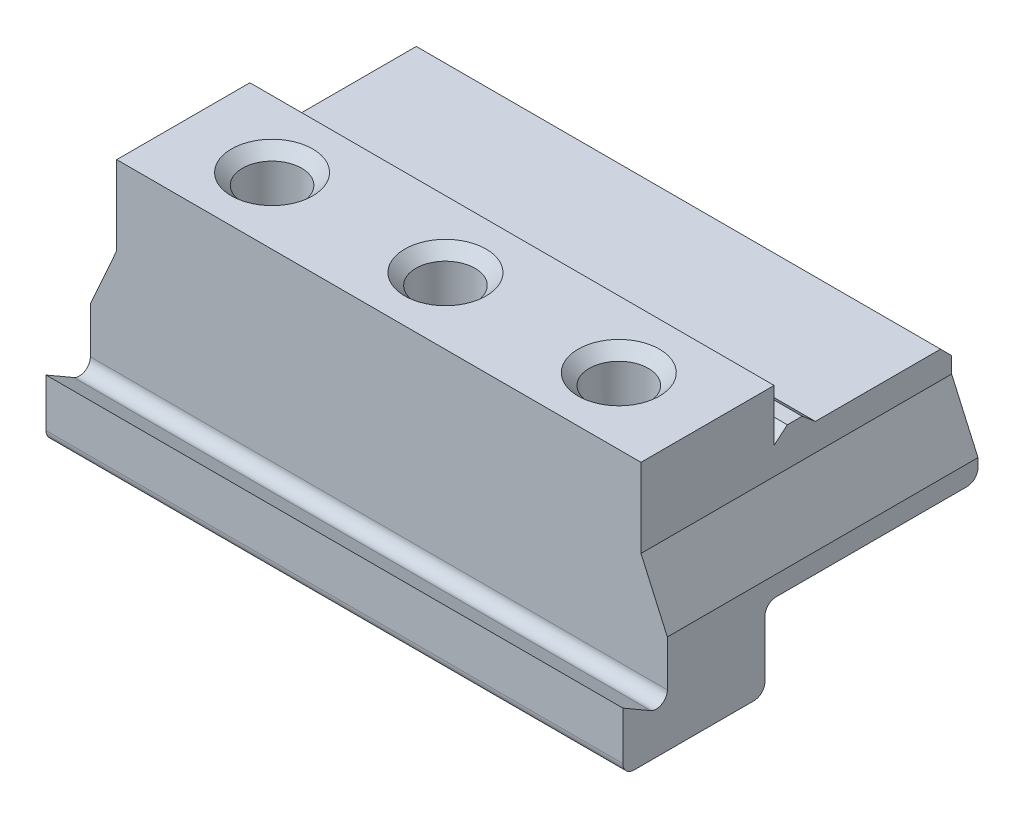
ISO-10303-21;
HEADER;
FILE_DESCRIPTION(('STEP AP214'),'2;1');
FILE_NAME('part.step','',(''),(''),'','','');
FILE_SCHEMA(('AUTOMOTIVE_DESIGN { 1 0 10303 214 1 1 1 1 }'));
ENDSEC;
DATA;
#1=APPLICATION_CONTEXT('core data for automotive mechanical design processes');
#2=APPLICATION_PROTOCOL_DEFINITION('international standard','automotive_design',2000,#1);
#3=PRODUCT_CONTEXT('',#1,'mechanical');
#4=PRODUCT('Part','Part','',(#3));
#5=PRODUCT_RELATED_PRODUCT_CATEGORY('part','',(#4));
#6=PRODUCT_DEFINITION_FORMATION('','',#4);
#7=PRODUCT_DEFINITION_CONTEXT('part definition',#1,'design');
#8=PRODUCT_DEFINITION('design','',#6,#7);
#9=PRODUCT_DEFINITION_SHAPE('','',#8);
#10=(LENGTH_UNIT() NAMED_UNIT(*) SI_UNIT(.MILLI.,.METRE.));
#11=(NAMED_UNIT(*) PLANE_ANGLE_UNIT() SI_UNIT($,.RADIAN.));
#12=(NAMED_UNIT(*) SI_UNIT($,.STERADIAN.) SOLID_ANGLE_UNIT());
#13=UNCERTAINTY_MEASURE_WITH_UNIT(LENGTH_MEASURE(1.E-05),#10,'distance_accuracy_value','');
#14=(GEOMETRIC_REPRESENTATION_CONTEXT(3) GLOBAL_UNCERTAINTY_ASSIGNED_CONTEXT((#13)) GLOBAL_UNIT_ASSIGNED_CONTEXT((#10,
#11,#12)) REPRESENTATION_CONTEXT('',''));
#15=CARTESIAN_POINT('',(0.,0.,0.));
#16=DIRECTION('',(0.,0.,1.));
#17=DIRECTION('',(1.,0.,0.));
#18=AXIS2_PLACEMENT_3D('',#15,#16,#17);
#19=CARTESIAN_POINT('',(39.,32.,24.));
#20=DIRECTION('',(-1.,0.,0.));
#21=DIRECTION('',(0.,0.,1.));
#22=AXIS2_PLACEMENT_3D('',#19,#20,#21);
#23=PLANE('',#22);
#24=DIRECTION('',(0.,0.,1.));
#25=VECTOR('',#24,1.);
#26=CARTESIAN_POINT('',(39.,10.67,24.));
#27=LINE('',#26,#25);
#28=CARTESIAN_POINT('',(39.,10.67,-22.5));
#29=VERTEX_POINT('',#28);
#30=CARTESIAN_POINT('',(39.,10.67,3.3));
#31=VERTEX_POINT('',#30);
#32=EDGE_CURVE('E420',#29,#31,#27,.T.);
#33=ORIENTED_EDGE('',*,*,#32,.F.);
#34=CARTESIAN_POINT('',(39.,12.17,-22.5));
#35=DIRECTION('',(-1.,0.,0.));
#36=DIRECTION('',(0.,0.,1.));
#37=AXIS2_PLACEMENT_3D('',#34,#35,#36);
#38=CIRCLE('',#37,1.5);
#39=CARTESIAN_POINT('',(39.,12.17,-24.));
#40=VERTEX_POINT('',#39);
#41=EDGE_CURVE('E263',#29,#40,#38,.F.);
#42=ORIENTED_EDGE('',*,*,#41,.T.);
#43=DIRECTION('',(0.,-1.,0.));
#44=VECTOR('',#43,1.);
#45=CARTESIAN_POINT('',(39.,32.,-24.));
#46=LINE('',#45,#44);
#47=CARTESIAN_POINT('',(39.,13.33,-24.));
#48=VERTEX_POINT('',#47);
#49=EDGE_CURVE('E234',#48,#40,#46,.T.);
#50=ORIENTED_EDGE('',*,*,#49,.F.);
#51=DIRECTION('',(0.,0.,1.));
#52=VECTOR('',#51,1.);
#53=CARTESIAN_POINT('',(39.,13.33,-24.));
#54=LINE('',#53,#52);
#55=CARTESIAN_POINT('',(39.,13.33,18.));
#56=VERTEX_POINT('',#55);
#57=EDGE_CURVE('E417',#48,#56,#54,.T.);
#58=ORIENTED_EDGE('',*,*,#57,.T.);
#59=DIRECTION('',(0.,1.,0.));
#60=VECTOR('',#59,1.);
#61=CARTESIAN_POINT('',(39.,32.,18.));
#62=LINE('',#61,#60);
#63=CARTESIAN_POINT('',(39.,7.13397459621554,18.));
#64=VERTEX_POINT('',#63);
#65=EDGE_CURVE('E441',#64,#56,#62,.T.);
#66=ORIENTED_EDGE('',*,*,#65,.F.);
#67=CARTESIAN_POINT('',(39.,7.13397459621554,19.5));
#68=DIRECTION('',(-1.,0.,0.));
#69=DIRECTION('',(0.,0.,1.));
#70=AXIS2_PLACEMENT_3D('',#67,#68,#69);
#71=CIRCLE('',#70,1.5);
#72=CARTESIAN_POINT('',(39.,5.83493649053888,20.25));
#73=VERTEX_POINT('',#72);
#74=EDGE_CURVE('E292',#64,#73,#71,.T.);
#75=ORIENTED_EDGE('',*,*,#74,.T.);
#76=DIRECTION('',(0.,-0.500000000000004,-0.866025403784436));
#77=VECTOR('',#76,1.);
#78=CARTESIAN_POINT('',(39.,14.0000000000001,34.3923048454133));
#79=LINE('',#78,#77);
#80=CARTESIAN_POINT('',(39.,8.,24.));
#81=VERTEX_POINT('',#80);
#82=EDGE_CURVE('E435',#81,#73,#79,.T.);
#83=ORIENTED_EDGE('',*,*,#82,.F.);
#84=DIRECTION('',(0.,-1.,0.));
#85=VECTOR('',#84,1.);
#86=CARTESIAN_POINT('',(39.,32.,24.));
#87=LINE('',#86,#85);
#88=CARTESIAN_POINT('',(39.,1.5,24.));
#89=VERTEX_POINT('',#88);
#90=EDGE_CURVE('E223',#81,#89,#87,.T.);
#91=ORIENTED_EDGE('',*,*,#90,.T.);
#92=CARTESIAN_POINT('',(39.,1.5,22.5));
#93=DIRECTION('',(-1.,0.,0.));
#94=DIRECTION('',(0.,0.,1.));
#95=AXIS2_PLACEMENT_3D('',#92,#93,#94);
#96=CIRCLE('',#95,1.5);
#97=CARTESIAN_POINT('',(39.,0.,22.5));
#98=VERTEX_POINT('',#97);
#99=EDGE_CURVE('E259',#89,#98,#96,.F.);
#100=ORIENTED_EDGE('',*,*,#99,.T.);
#101=DIRECTION('',(0.,0.,-1.));
#102=VECTOR('',#101,1.);
#103=CARTESIAN_POINT('',(39.,0.,24.));
#104=LINE('',#103,#102);
#105=CARTESIAN_POINT('',(39.,0.,6.3));
#106=VERTEX_POINT('',#105);
#107=EDGE_CURVE('E411',#98,#106,#104,.T.);
#108=ORIENTED_EDGE('',*,*,#107,.T.);
#109=CARTESIAN_POINT('',(39.,1.5,6.3));
#110=DIRECTION('',(-1.,0.,0.));
#111=DIRECTION('',(0.,0.,1.));
#112=AXIS2_PLACEMENT_3D('',#109,#110,#111);
#113=CIRCLE('',#112,1.5);
#114=CARTESIAN_POINT('',(39.,1.5,4.8));
#115=VERTEX_POINT('',#114);
#116=EDGE_CURVE('E261',#106,#115,#113,.F.);
#117=ORIENTED_EDGE('',*,*,#116,.T.);
#118=DIRECTION('',(0.,-1.,0.));
#119=VECTOR('',#118,1.);
#120=CARTESIAN_POINT('',(39.,32.,4.8));
#121=LINE('',#120,#119);
#122=CARTESIAN_POINT('',(39.,9.17,4.8));
#123=VERTEX_POINT('',#122);
#124=EDGE_CURVE('E437',#123,#115,#121,.T.);
#125=ORIENTED_EDGE('',*,*,#124,.F.);
#126=CARTESIAN_POINT('',(39.,9.17,3.3));
#127=DIRECTION('',(-1.,0.,0.));
#128=DIRECTION('',(0.,0.,1.));
#129=AXIS2_PLACEMENT_3D('',#126,#127,#128);
#130=CIRCLE('',#129,1.5);
#131=EDGE_CURVE('E288',#123,#31,#130,.T.);
#132=ORIENTED_EDGE('',*,*,#131,.T.);
#133=EDGE_LOOP('',(#33,#42,#50,#58,#66,#75,#83,#91,#100,#108,#117,#125,#132));
#134=FACE_BOUND('',#133,.T.);
#135=ADVANCED_FACE('F45',(#134),#23,.F.);
#136=CARTESIAN_POINT('',(-39.,32.,-24.));
#137=DIRECTION('',(0.,0.,1.));
#138=DIRECTION('',(1.,0.,0.));
#139=AXIS2_PLACEMENT_3D('',#136,#137,#138);
#140=PLANE('',#139);
#141=DIRECTION('',(0.,1.,0.));
#142=VECTOR('',#141,1.);
#143=CARTESIAN_POINT('',(-35.4381705175318,21.33,-24.));
#144=LINE('',#143,#142);
#145=CARTESIAN_POINT('',(-35.4381705175318,21.33,-24.));
#146=VERTEX_POINT('',#145);
#147=CARTESIAN_POINT('',(-35.4381705175318,23.5,-24.));
#148=VERTEX_POINT('',#147);
#149=EDGE_CURVE('E394',#146,#148,#144,.T.);
#150=ORIENTED_EDGE('',*,*,#149,.T.);
#151=DIRECTION('',(1.,0.,0.));
#152=VECTOR('',#151,1.);
#153=CARTESIAN_POINT('',(35.4381705175318,23.5,-24.));
#154=LINE('',#153,#152);
#155=CARTESIAN_POINT('',(35.4381705175318,23.5,-24.));
#156=VERTEX_POINT('',#155);
#157=EDGE_CURVE('E296',#148,#156,#154,.T.);
#158=ORIENTED_EDGE('',*,*,#157,.T.);
#159=DIRECTION('',(0.,-1.,0.));
#160=VECTOR('',#159,1.);
#161=CARTESIAN_POINT('',(35.4381705175318,21.33,-24.));
#162=LINE('',#161,#160);
#163=CARTESIAN_POINT('',(35.4381705175318,21.33,-24.));
#164=VERTEX_POINT('',#163);
#165=EDGE_CURVE('E404',#156,#164,#162,.T.);
#166=ORIENTED_EDGE('',*,*,#165,.T.);
#167=DIRECTION('',(0.406736643075794,-0.913545457642603,0.));
#168=VECTOR('',#167,1.);
#169=CARTESIAN_POINT('',(39.,13.33,-24.));
#170=LINE('',#169,#168);
#171=EDGE_CURVE('E423',#164,#48,#170,.T.);
#172=ORIENTED_EDGE('',*,*,#171,.T.);
#173=ORIENTED_EDGE('',*,*,#49,.T.);
#174=DIRECTION('',(1.,0.,0.));
#175=VECTOR('',#174,1.);
#176=CARTESIAN_POINT('',(-39.,12.17,-24.));
#177=LINE('',#176,#175);
#178=CARTESIAN_POINT('',(-39.,12.17,-24.));
#179=VERTEX_POINT('',#178);
#180=EDGE_CURVE('E265',#40,#179,#177,.F.);
#181=ORIENTED_EDGE('',*,*,#180,.T.);
#182=DIRECTION('',(0.,-1.,0.));
#183=VECTOR('',#182,1.);
#184=CARTESIAN_POINT('',(-39.,32.,-24.));
#185=LINE('',#184,#183);
#186=CARTESIAN_POINT('',(-39.,13.33,-24.));
#187=VERTEX_POINT('',#186);
#188=EDGE_CURVE('E232',#187,#179,#185,.T.);
#189=ORIENTED_EDGE('',*,*,#188,.F.);
#190=DIRECTION('',(0.406736643075794,0.913545457642603,0.));
#191=VECTOR('',#190,1.);
#192=CARTESIAN_POINT('',(-39.,13.33,-24.));
#193=LINE('',#192,#191);
#194=EDGE_CURVE('E398',#187,#146,#193,.T.);
#195=ORIENTED_EDGE('',*,*,#194,.T.);
#196=EDGE_LOOP('',(#150,#158,#166,#172,#173,#181,#189,#195));
#197=FACE_BOUND('',#196,.T.);
#198=ADVANCED_FACE('F335',(#197),#140,.F.);
#199=CARTESIAN_POINT('',(-39.,32.,24.));
#200=DIRECTION('',(1.,0.,0.));
#201=DIRECTION('',(0.,0.,-1.));
#202=AXIS2_PLACEMENT_3D('',#199,#200,#201);
#203=PLANE('',#202);
#204=ORIENTED_EDGE('',*,*,#188,.T.);
#205=CARTESIAN_POINT('',(-39.,12.17,-22.5));
#206=DIRECTION('',(1.,0.,0.));
#207=DIRECTION('',(0.,0.,-1.));
#208=AXIS2_PLACEMENT_3D('',#205,#206,#207);
#209=CIRCLE('',#208,1.5);
#210=CARTESIAN_POINT('',(-39.,10.67,-22.5));
#211=VERTEX_POINT('',#210);
#212=EDGE_CURVE('E270',#179,#211,#209,.F.);
#213=ORIENTED_EDGE('',*,*,#212,.T.);
#214=DIRECTION('',(0.,0.,-1.));
#215=VECTOR('',#214,1.);
#216=CARTESIAN_POINT('',(-39.,10.67,-24.));
#217=LINE('',#216,#215);
#218=CARTESIAN_POINT('',(-39.,10.67,3.3));
#219=VERTEX_POINT('',#218);
#220=EDGE_CURVE('E477',#219,#211,#217,.T.);
#221=ORIENTED_EDGE('',*,*,#220,.F.);
#222=CARTESIAN_POINT('',(-39.,9.17,3.3));
#223=DIRECTION('',(1.,0.,0.));
#224=DIRECTION('',(0.,0.,-1.));
#225=AXIS2_PLACEMENT_3D('',#222,#223,#224);
#226=CIRCLE('',#225,1.5);
#227=CARTESIAN_POINT('',(-39.,9.17,4.8));
#228=VERTEX_POINT('',#227);
#229=EDGE_CURVE('E290',#219,#228,#226,.T.);
#230=ORIENTED_EDGE('',*,*,#229,.T.);
#231=DIRECTION('',(0.,1.,0.));
#232=VECTOR('',#231,1.);
#233=CARTESIAN_POINT('',(-39.,10.67,4.8));
#234=LINE('',#233,#232);
#235=CARTESIAN_POINT('',(-39.,1.5,4.8));
#236=VERTEX_POINT('',#235);
#237=EDGE_CURVE('E480',#236,#228,#234,.T.);
#238=ORIENTED_EDGE('',*,*,#237,.F.);
#239=CARTESIAN_POINT('',(-39.,1.5,6.3));
#240=DIRECTION('',(1.,0.,0.));
#241=DIRECTION('',(0.,0.,-1.));
#242=AXIS2_PLACEMENT_3D('',#239,#240,#241);
#243=CIRCLE('',#242,1.5);
#244=CARTESIAN_POINT('',(-39.,0.,6.3));
#245=VERTEX_POINT('',#244);
#246=EDGE_CURVE('E268',#236,#245,#243,.F.);
#247=ORIENTED_EDGE('',*,*,#246,.T.);
#248=DIRECTION('',(0.,0.,1.));
#249=VECTOR('',#248,1.);
#250=CARTESIAN_POINT('',(-39.,0.,24.));
#251=LINE('',#250,#249);
#252=CARTESIAN_POINT('',(-39.,0.,22.5));
#253=VERTEX_POINT('',#252);
#254=EDGE_CURVE('E236',#245,#253,#251,.T.);
#255=ORIENTED_EDGE('',*,*,#254,.T.);
#256=CARTESIAN_POINT('',(-39.,1.5,22.5));
#257=DIRECTION('',(1.,0.,0.));
#258=DIRECTION('',(0.,0.,-1.));
#259=AXIS2_PLACEMENT_3D('',#256,#257,#258);
#260=CIRCLE('',#259,1.5);
#261=CARTESIAN_POINT('',(-39.,1.5,24.));
#262=VERTEX_POINT('',#261);
#263=EDGE_CURVE('E231',#253,#262,#260,.F.);
#264=ORIENTED_EDGE('',*,*,#263,.T.);
#265=DIRECTION('',(0.,-1.,0.));
#266=VECTOR('',#265,1.);
#267=CARTESIAN_POINT('',(-39.,32.,24.));
#268=LINE('',#267,#266);
#269=CARTESIAN_POINT('',(-39.,8.,24.));
#270=VERTEX_POINT('',#269);
#271=EDGE_CURVE('E220',#270,#262,#268,.T.);
#272=ORIENTED_EDGE('',*,*,#271,.F.);
#273=DIRECTION('',(0.,0.500000000000004,0.866025403784436));
#274=VECTOR('',#273,1.);
#275=CARTESIAN_POINT('',(-39.,8.,24.));
#276=LINE('',#275,#274);
#277=CARTESIAN_POINT('',(-39.,5.83493649053888,20.25));
#278=VERTEX_POINT('',#277);
#279=EDGE_CURVE('E201',#278,#270,#276,.T.);
#280=ORIENTED_EDGE('',*,*,#279,.F.);
#281=CARTESIAN_POINT('',(-39.,7.13397459621554,19.5));
#282=DIRECTION('',(1.,0.,0.));
#283=DIRECTION('',(0.,0.,-1.));
#284=AXIS2_PLACEMENT_3D('',#281,#282,#283);
#285=CIRCLE('',#284,1.5);
#286=CARTESIAN_POINT('',(-39.,7.13397459621554,18.));
#287=VERTEX_POINT('',#286);
#288=EDGE_CURVE('E294',#278,#287,#285,.T.);
#289=ORIENTED_EDGE('',*,*,#288,.T.);
#290=DIRECTION('',(0.,-1.,0.));
#291=VECTOR('',#290,1.);
#292=CARTESIAN_POINT('',(-39.,4.53589838486221,18.));
#293=LINE('',#292,#291);
#294=CARTESIAN_POINT('',(-39.,13.33,18.));
#295=VERTEX_POINT('',#294);
#296=EDGE_CURVE('E213',#295,#287,#293,.T.);
#297=ORIENTED_EDGE('',*,*,#296,.F.);
#298=DIRECTION('',(0.,0.,1.));
#299=VECTOR('',#298,1.);
#300=CARTESIAN_POINT('',(-39.,13.33,-24.));
#301=LINE('',#300,#299);
#302=EDGE_CURVE('E399',#187,#295,#301,.T.);
#303=ORIENTED_EDGE('',*,*,#302,.F.);
#304=EDGE_LOOP('',(#204,#213,#221,#230,#238,#247,#255,#264,#272,#280,#289,#297,#303));
#305=FACE_BOUND('',#304,.T.);
#306=ADVANCED_FACE('F228',(#305),#203,.F.);
#307=CARTESIAN_POINT('',(-39.,32.,24.));
#308=DIRECTION('',(0.,0.,-1.));
#309=DIRECTION('',(-1.,0.,0.));
#310=AXIS2_PLACEMENT_3D('',#307,#308,#309);
#311=PLANE('',#310);
#312=ORIENTED_EDGE('',*,*,#271,.T.);
#313=DIRECTION('',(1.,0.,0.));
#314=VECTOR('',#313,1.);
#315=CARTESIAN_POINT('',(39.,1.5,24.));
#316=LINE('',#315,#314);
#317=EDGE_CURVE('E282',#262,#89,#316,.T.);
#318=ORIENTED_EDGE('',*,*,#317,.T.);
#319=ORIENTED_EDGE('',*,*,#90,.F.);
#320=DIRECTION('',(1.,0.,0.));
#321=VECTOR('',#320,1.);
#322=CARTESIAN_POINT('',(-39.,8.,24.));
#323=LINE('',#322,#321);
#324=EDGE_CURVE('E205',#270,#81,#323,.T.);
#325=ORIENTED_EDGE('',*,*,#324,.F.);
#326=EDGE_LOOP('',(#312,#318,#319,#325));
#327=FACE_BOUND('',#326,.T.);
#328=ADVANCED_FACE('F218',(#327),#311,.F.);
#329=CARTESIAN_POINT('',(0.,32.,0.));
#330=DIRECTION('',(0.,-1.,0.));
#331=DIRECTION('',(0.,0.,-1.));
#332=AXIS2_PLACEMENT_3D('',#329,#330,#331);
#333=PLANE('',#332);
#334=CARTESIAN_POINT('',(-23.4381705175318,32.,9.00000000000001));
#335=DIRECTION('',(0.,-1.,0.));
#336=DIRECTION('',(0.,0.,-1.));
#337=AXIS2_PLACEMENT_3D('',#334,#335,#336);
#338=CIRCLE('',#337,5.50000000000005);
#339=CARTESIAN_POINT('',(-23.4381705175318,32.,3.49999999999996));
#340=VERTEX_POINT('',#339);
#341=EDGE_CURVE('E312',#340,#340,#338,.T.);
#342=ORIENTED_EDGE('',*,*,#341,.T.);
#343=EDGE_LOOP('',(#342));
#344=FACE_BOUND('',#343,.T.);
#345=CARTESIAN_POINT('',(0.,32.,9.));
#346=DIRECTION('',(0.,-1.,0.));
#347=DIRECTION('',(0.,0.,-1.));
#348=AXIS2_PLACEMENT_3D('',#345,#346,#347);
#349=CIRCLE('',#348,5.50000000000005);
#350=CARTESIAN_POINT('',(0.,32.,3.49999999999996));
#351=VERTEX_POINT('',#350);
#352=EDGE_CURVE('E309',#351,#351,#349,.T.);
#353=ORIENTED_EDGE('',*,*,#352,.T.);
#354=EDGE_LOOP('',(#353));
#355=FACE_BOUND('',#354,.T.);
#356=CARTESIAN_POINT('',(23.4381705175318,32.,9.00000000000001));
#357=DIRECTION('',(0.,-1.,0.));
#358=DIRECTION('',(0.,0.,-1.));
#359=AXIS2_PLACEMENT_3D('',#356,#357,#358);
#360=CIRCLE('',#359,5.50000000000005);
#361=CARTESIAN_POINT('',(23.4381705175318,32.,3.49999999999996));
#362=VERTEX_POINT('',#361);
#363=EDGE_CURVE('E306',#362,#362,#360,.T.);
#364=ORIENTED_EDGE('',*,*,#363,.T.);
#365=EDGE_LOOP('',(#364));
#366=FACE_BOUND('',#365,.T.);
#367=DIRECTION('',(1.,0.,0.));
#368=VECTOR('',#367,1.);
#369=CARTESIAN_POINT('',(-39.,32.,18.));
#370=LINE('',#369,#368);
#371=CARTESIAN_POINT('',(-35.4381705175318,32.,18.));
#372=VERTEX_POINT('',#371);
#373=CARTESIAN_POINT('',(35.4381705175318,32.,18.));
#374=VERTEX_POINT('',#373);
#375=EDGE_CURVE('E225',#372,#374,#370,.T.);
#376=ORIENTED_EDGE('',*,*,#375,.T.);
#377=DIRECTION('',(0.,0.,1.));
#378=VECTOR('',#377,1.);
#379=CARTESIAN_POINT('',(35.4381705175318,32.,-24.));
#380=LINE('',#379,#378);
#381=CARTESIAN_POINT('',(35.4381705175318,32.,0.));
#382=VERTEX_POINT('',#381);
#383=EDGE_CURVE('E416',#382,#374,#380,.T.);
#384=ORIENTED_EDGE('',*,*,#383,.F.);
#385=DIRECTION('',(1.,0.,0.));
#386=VECTOR('',#385,1.);
#387=CARTESIAN_POINT('',(-39.,32.,0.));
#388=LINE('',#387,#386);
#389=CARTESIAN_POINT('',(-35.4381705175318,32.,0.));
#390=VERTEX_POINT('',#389);
#391=EDGE_CURVE('E471',#390,#382,#388,.T.);
#392=ORIENTED_EDGE('',*,*,#391,.F.);
#393=DIRECTION('',(0.,0.,1.));
#394=VECTOR('',#393,1.);
#395=CARTESIAN_POINT('',(-35.4381705175318,32.,-24.));
#396=LINE('',#395,#394);
#397=EDGE_CURVE('E408',#390,#372,#396,.T.);
#398=ORIENTED_EDGE('',*,*,#397,.T.);
#399=EDGE_LOOP('',(#376,#384,#392,#398));
#400=FACE_BOUND('',#399,.T.);
#401=ADVANCED_FACE('F559',(#344,#355,#366,#400),#333,.F.);
#402=CARTESIAN_POINT('',(0.,0.,0.));
#403=DIRECTION('',(0.,-1.,0.));
#404=DIRECTION('',(0.,0.,-1.));
#405=AXIS2_PLACEMENT_3D('',#402,#403,#404);
#406=PLANE('',#405);
#407=ORIENTED_EDGE('',*,*,#254,.F.);
#408=DIRECTION('',(1.,0.,0.));
#409=VECTOR('',#408,1.);
#410=CARTESIAN_POINT('',(0.,0.,6.3));
#411=LINE('',#410,#409);
#412=EDGE_CURVE('E279',#245,#106,#411,.T.);
#413=ORIENTED_EDGE('',*,*,#412,.T.);
#414=ORIENTED_EDGE('',*,*,#107,.F.);
#415=DIRECTION('',(1.,0.,0.));
#416=VECTOR('',#415,1.);
#417=CARTESIAN_POINT('',(-39.,0.,22.5));
#418=LINE('',#417,#416);
#419=EDGE_CURVE('E277',#98,#253,#418,.F.);
#420=ORIENTED_EDGE('',*,*,#419,.T.);
#421=EDGE_LOOP('',(#407,#413,#414,#420));
#422=FACE_BOUND('',#421,.T.);
#423=ADVANCED_FACE('F557',(#422),#406,.T.);
#424=CARTESIAN_POINT('',(39.,13.33,-24.));
#425=DIRECTION('',(-0.913545457642604,-0.406736643075794,0.));
#426=DIRECTION('',(0.406736643075794,-0.913545457642604,0.));
#427=AXIS2_PLACEMENT_3D('',#424,#425,#426);
#428=PLANE('',#427);
#429=DIRECTION('',(-0.406736643075794,0.913545457642604,0.));
#430=VECTOR('',#429,1.);
#431=CARTESIAN_POINT('',(39.,13.33,18.));
#432=LINE('',#431,#430);
#433=CARTESIAN_POINT('',(35.4381705175318,21.33,18.));
#434=VERTEX_POINT('',#433);
#435=EDGE_CURVE('E445',#56,#434,#432,.T.);
#436=ORIENTED_EDGE('',*,*,#435,.F.);
#437=ORIENTED_EDGE('',*,*,#57,.F.);
#438=ORIENTED_EDGE('',*,*,#171,.F.);
#439=DIRECTION('',(0.,0.,1.));
#440=VECTOR('',#439,1.);
#441=CARTESIAN_POINT('',(35.4381705175318,21.33,-24.));
#442=LINE('',#441,#440);
#443=EDGE_CURVE('E413',#164,#434,#442,.T.);
#444=ORIENTED_EDGE('',*,*,#443,.T.);
#445=EDGE_LOOP('',(#436,#437,#438,#444));
#446=FACE_BOUND('',#445,.T.);
#447=ADVANCED_FACE('F554',(#446),#428,.F.);
#448=CARTESIAN_POINT('',(35.4381705175318,21.33,-24.));
#449=DIRECTION('',(-1.,0.,0.));
#450=DIRECTION('',(0.,0.,1.));
#451=AXIS2_PLACEMENT_3D('',#448,#449,#450);
#452=PLANE('',#451);
#453=ORIENTED_EDGE('',*,*,#165,.F.);
#454=DIRECTION('',(0.,0.707106781186544,0.707106781186551));
#455=VECTOR('',#454,1.);
#456=CARTESIAN_POINT('',(35.4381705175318,23.5,-24.));
#457=LINE('',#456,#455);
#458=CARTESIAN_POINT('',(35.4381705175318,25.,-22.5));
#459=VERTEX_POINT('',#458);
#460=EDGE_CURVE('E69',#156,#459,#457,.T.);
#461=ORIENTED_EDGE('',*,*,#460,.T.);
#462=DIRECTION('',(0.,0.,-1.));
#463=VECTOR('',#462,1.);
#464=CARTESIAN_POINT('',(35.4381705175318,25.,-24.));
#465=LINE('',#464,#463);
#466=CARTESIAN_POINT('',(35.4381705175318,25.,-5.57526077778262));
#467=VERTEX_POINT('',#466);
#468=EDGE_CURVE('E224',#467,#459,#465,.T.);
#469=ORIENTED_EDGE('',*,*,#468,.F.);
#470=DIRECTION('',(0.,-0.642787609686541,-0.766044443118977));
#471=VECTOR('',#470,1.);
#472=CARTESIAN_POINT('',(35.4381705175318,14.4112313893849,-18.1944638106319));
#473=LINE('',#472,#471);
#474=CARTESIAN_POINT('',(35.4381705175318,26.5,-3.78763038889131));
#475=VERTEX_POINT('',#474);
#476=EDGE_CURVE('E457',#475,#467,#473,.T.);
#477=ORIENTED_EDGE('',*,*,#476,.F.);
#478=DIRECTION('',(0.,0.,-1.));
#479=VECTOR('',#478,1.);
#480=CARTESIAN_POINT('',(35.4381705175318,26.5,-24.));
#481=LINE('',#480,#479);
#482=CARTESIAN_POINT('',(35.4381705175318,26.5,-1.78763038889131));
#483=VERTEX_POINT('',#482);
#484=EDGE_CURVE('E455',#483,#475,#481,.T.);
#485=ORIENTED_EDGE('',*,*,#484,.F.);
#486=DIRECTION('',(0.,0.642787609686541,-0.766044443118977));
#487=VECTOR('',#486,1.);
#488=CARTESIAN_POINT('',(35.4381705175318,35.3013374421653,-12.2766559052257));
#489=LINE('',#488,#487);
#490=CARTESIAN_POINT('',(35.4381705175318,25.,0.));
#491=VERTEX_POINT('',#490);
#492=EDGE_CURVE('E453',#491,#483,#489,.T.);
#493=ORIENTED_EDGE('',*,*,#492,.F.);
#494=DIRECTION('',(0.,-1.,0.));
#495=VECTOR('',#494,1.);
#496=CARTESIAN_POINT('',(35.4381705175318,21.33,0.));
#497=LINE('',#496,#495);
#498=EDGE_CURVE('E451',#382,#491,#497,.T.);
#499=ORIENTED_EDGE('',*,*,#498,.F.);
#500=ORIENTED_EDGE('',*,*,#383,.T.);
#501=DIRECTION('',(0.,1.,0.));
#502=VECTOR('',#501,1.);
#503=CARTESIAN_POINT('',(35.4381705175318,21.33,18.));
#504=LINE('',#503,#502);
#505=EDGE_CURVE('E447',#434,#374,#504,.T.);
#506=ORIENTED_EDGE('',*,*,#505,.F.);
#507=ORIENTED_EDGE('',*,*,#443,.F.);
#508=EDGE_LOOP('',(#453,#461,#469,#477,#485,#493,#499,#500,#506,#507));
#509=FACE_BOUND('',#508,.T.);
#510=ADVANCED_FACE('F550',(#509),#452,.F.);
#511=CARTESIAN_POINT('',(-39.,13.33,-24.));
#512=DIRECTION('',(0.913545457642604,-0.406736643075794,0.));
#513=DIRECTION('',(0.406736643075794,0.913545457642604,0.));
#514=AXIS2_PLACEMENT_3D('',#511,#512,#513);
#515=PLANE('',#514);
#516=DIRECTION('',(-0.406736643075794,-0.913545457642604,0.));
#517=VECTOR('',#516,1.);
#518=CARTESIAN_POINT('',(-39.,13.33,18.));
#519=LINE('',#518,#517);
#520=CARTESIAN_POINT('',(-35.4381705175318,21.33,18.));
#521=VERTEX_POINT('',#520);
#522=EDGE_CURVE('E449',#521,#295,#519,.T.);
#523=ORIENTED_EDGE('',*,*,#522,.F.);
#524=DIRECTION('',(0.,0.,1.));
#525=VECTOR('',#524,1.);
#526=CARTESIAN_POINT('',(-35.4381705175318,21.33,-24.));
#527=LINE('',#526,#525);
#528=EDGE_CURVE('E402',#146,#521,#527,.T.);
#529=ORIENTED_EDGE('',*,*,#528,.F.);
#530=ORIENTED_EDGE('',*,*,#194,.F.);
#531=ORIENTED_EDGE('',*,*,#302,.T.);
#532=EDGE_LOOP('',(#523,#529,#530,#531));
#533=FACE_BOUND('',#532,.T.);
#534=ADVANCED_FACE('F547',(#533),#515,.F.);
#535=CARTESIAN_POINT('',(-35.4381705175318,21.33,-24.));
#536=DIRECTION('',(1.,0.,0.));
#537=DIRECTION('',(0.,0.,-1.));
#538=AXIS2_PLACEMENT_3D('',#535,#536,#537);
#539=PLANE('',#538);
#540=DIRECTION('',(0.,0.,1.));
#541=VECTOR('',#540,1.);
#542=CARTESIAN_POINT('',(-35.4381705175318,25.,-24.));
#543=LINE('',#542,#541);
#544=CARTESIAN_POINT('',(-35.4381705175318,25.,-22.5));
#545=VERTEX_POINT('',#544);
#546=CARTESIAN_POINT('',(-35.4381705175318,25.,-5.57526077778262));
#547=VERTEX_POINT('',#546);
#548=EDGE_CURVE('E242',#545,#547,#543,.T.);
#549=ORIENTED_EDGE('',*,*,#548,.F.);
#550=DIRECTION('',(0.,-0.707106781186544,-0.707106781186551));
#551=VECTOR('',#550,1.);
#552=CARTESIAN_POINT('',(-35.4381705175318,23.5,-24.));
#553=LINE('',#552,#551);
#554=EDGE_CURVE('E301',#545,#148,#553,.T.);
#555=ORIENTED_EDGE('',*,*,#554,.T.);
#556=ORIENTED_EDGE('',*,*,#149,.F.);
#557=ORIENTED_EDGE('',*,*,#528,.T.);
#558=DIRECTION('',(0.,-1.,0.));
#559=VECTOR('',#558,1.);
#560=CARTESIAN_POINT('',(-35.4381705175318,21.33,18.));
#561=LINE('',#560,#559);
#562=EDGE_CURVE('E252',#372,#521,#561,.T.);
#563=ORIENTED_EDGE('',*,*,#562,.F.);
#564=ORIENTED_EDGE('',*,*,#397,.F.);
#565=DIRECTION('',(0.,1.,0.));
#566=VECTOR('',#565,1.);
#567=CARTESIAN_POINT('',(-35.4381705175318,21.33,0.));
#568=LINE('',#567,#566);
#569=CARTESIAN_POINT('',(-35.4381705175318,25.,0.));
#570=VERTEX_POINT('',#569);
#571=EDGE_CURVE('E250',#570,#390,#568,.T.);
#572=ORIENTED_EDGE('',*,*,#571,.F.);
#573=DIRECTION('',(0.,-0.642787609686541,0.766044443118977));
#574=VECTOR('',#573,1.);
#575=CARTESIAN_POINT('',(-35.4381705175318,35.3013374421653,-12.2766559052257));
#576=LINE('',#575,#574);
#577=CARTESIAN_POINT('',(-35.4381705175318,26.5,-1.78763038889131));
#578=VERTEX_POINT('',#577);
#579=EDGE_CURVE('E248',#578,#570,#576,.T.);
#580=ORIENTED_EDGE('',*,*,#579,.F.);
#581=DIRECTION('',(0.,0.,1.));
#582=VECTOR('',#581,1.);
#583=CARTESIAN_POINT('',(-35.4381705175318,26.5,-24.));
#584=LINE('',#583,#582);
#585=CARTESIAN_POINT('',(-35.4381705175318,26.5,-3.78763038889131));
#586=VERTEX_POINT('',#585);
#587=EDGE_CURVE('E246',#586,#578,#584,.T.);
#588=ORIENTED_EDGE('',*,*,#587,.F.);
#589=DIRECTION('',(0.,0.642787609686541,0.766044443118977));
#590=VECTOR('',#589,1.);
#591=CARTESIAN_POINT('',(-35.4381705175318,14.4112313893849,-18.1944638106319));
#592=LINE('',#591,#590);
#593=EDGE_CURVE('E244',#547,#586,#592,.T.);
#594=ORIENTED_EDGE('',*,*,#593,.F.);
#595=EDGE_LOOP('',(#549,#555,#556,#557,#563,#564,#572,#580,#588,#594));
#596=FACE_BOUND('',#595,.T.);
#597=ADVANCED_FACE('F392',(#596),#539,.F.);
#598=CARTESIAN_POINT('',(-39.,25.,-5.57526077778262));
#599=DIRECTION('',(0.,1.,0.));
#600=DIRECTION('',(0.,0.,1.));
#601=AXIS2_PLACEMENT_3D('',#598,#599,#600);
#602=PLANE('',#601);
#603=ORIENTED_EDGE('',*,*,#468,.T.);
#604=DIRECTION('',(-1.,0.,0.));
#605=VECTOR('',#604,1.);
#606=CARTESIAN_POINT('',(-35.4381705175318,25.,-22.5));
#607=LINE('',#606,#605);
#608=EDGE_CURVE('E61',#459,#545,#607,.T.);
#609=ORIENTED_EDGE('',*,*,#608,.T.);
#610=ORIENTED_EDGE('',*,*,#548,.T.);
#611=DIRECTION('',(1.,0.,0.));
#612=VECTOR('',#611,1.);
#613=CARTESIAN_POINT('',(-39.,25.,-5.57526077778262));
#614=LINE('',#613,#612);
#615=EDGE_CURVE('E212',#547,#467,#614,.T.);
#616=ORIENTED_EDGE('',*,*,#615,.T.);
#617=EDGE_LOOP('',(#603,#609,#610,#616));
#618=FACE_BOUND('',#617,.T.);
#619=ADVANCED_FACE('F535',(#618),#602,.T.);
#620=CARTESIAN_POINT('',(-39.,26.5,-3.78763038889131));
#621=DIRECTION('',(0.,0.766044443118977,-0.642787609686541));
#622=DIRECTION('',(0.,0.642787609686541,0.766044443118977));
#623=AXIS2_PLACEMENT_3D('',#620,#621,#622);
#624=PLANE('',#623);
#625=ORIENTED_EDGE('',*,*,#476,.T.);
#626=ORIENTED_EDGE('',*,*,#615,.F.);
#627=ORIENTED_EDGE('',*,*,#593,.T.);
#628=DIRECTION('',(1.,0.,0.));
#629=VECTOR('',#628,1.);
#630=CARTESIAN_POINT('',(-39.,26.5,-3.78763038889131));
#631=LINE('',#630,#629);
#632=EDGE_CURVE('E462',#586,#475,#631,.T.);
#633=ORIENTED_EDGE('',*,*,#632,.T.);
#634=EDGE_LOOP('',(#625,#626,#627,#633));
#635=FACE_BOUND('',#634,.T.);
#636=ADVANCED_FACE('F531',(#635),#624,.T.);
#637=CARTESIAN_POINT('',(-39.,26.5,-1.78763038889131));
#638=DIRECTION('',(0.,1.,0.));
#639=DIRECTION('',(0.,0.,1.));
#640=AXIS2_PLACEMENT_3D('',#637,#638,#639);
#641=PLANE('',#640);
#642=ORIENTED_EDGE('',*,*,#484,.T.);
#643=ORIENTED_EDGE('',*,*,#632,.F.);
#644=ORIENTED_EDGE('',*,*,#587,.T.);
#645=DIRECTION('',(1.,0.,0.));
#646=VECTOR('',#645,1.);
#647=CARTESIAN_POINT('',(-39.,26.5,-1.78763038889131));
#648=LINE('',#647,#646);
#649=EDGE_CURVE('E465',#578,#483,#648,.T.);
#650=ORIENTED_EDGE('',*,*,#649,.T.);
#651=EDGE_LOOP('',(#642,#643,#644,#650));
#652=FACE_BOUND('',#651,.T.);
#653=ADVANCED_FACE('F527',(#652),#641,.T.);
#654=CARTESIAN_POINT('',(-39.,25.,0.));
#655=DIRECTION('',(0.,0.766044443118977,0.642787609686541));
#656=DIRECTION('',(0.,-0.642787609686541,0.766044443118977));
#657=AXIS2_PLACEMENT_3D('',#654,#655,#656);
#658=PLANE('',#657);
#659=ORIENTED_EDGE('',*,*,#492,.T.);
#660=ORIENTED_EDGE('',*,*,#649,.F.);
#661=ORIENTED_EDGE('',*,*,#579,.T.);
#662=DIRECTION('',(1.,0.,0.));
#663=VECTOR('',#662,1.);
#664=CARTESIAN_POINT('',(-39.,25.,0.));
#665=LINE('',#664,#663);
#666=EDGE_CURVE('E468',#570,#491,#665,.T.);
#667=ORIENTED_EDGE('',*,*,#666,.T.);
#668=EDGE_LOOP('',(#659,#660,#661,#667));
#669=FACE_BOUND('',#668,.T.);
#670=ADVANCED_FACE('F523',(#669),#658,.T.);
#671=CARTESIAN_POINT('',(-39.,32.,0.));
#672=DIRECTION('',(0.,0.,-1.));
#673=DIRECTION('',(0.,1.,0.));
#674=AXIS2_PLACEMENT_3D('',#671,#672,#673);
#675=PLANE('',#674);
#676=ORIENTED_EDGE('',*,*,#498,.T.);
#677=ORIENTED_EDGE('',*,*,#666,.F.);
#678=ORIENTED_EDGE('',*,*,#571,.T.);
#679=ORIENTED_EDGE('',*,*,#391,.T.);
#680=EDGE_LOOP('',(#676,#677,#678,#679));
#681=FACE_BOUND('',#680,.T.);
#682=ADVANCED_FACE('F519',(#681),#675,.T.);
#683=CARTESIAN_POINT('',(-39.,4.53589838486221,18.));
#684=DIRECTION('',(0.,0.,1.));
#685=DIRECTION('',(1.,0.,0.));
#686=AXIS2_PLACEMENT_3D('',#683,#684,#685);
#687=PLANE('',#686);
#688=ORIENTED_EDGE('',*,*,#296,.T.);
#689=DIRECTION('',(1.,0.,0.));
#690=VECTOR('',#689,1.);
#691=CARTESIAN_POINT('',(39.,7.13397459621554,18.));
#692=LINE('',#691,#690);
#693=EDGE_CURVE('E284',#287,#64,#692,.T.);
#694=ORIENTED_EDGE('',*,*,#693,.T.);
#695=ORIENTED_EDGE('',*,*,#65,.T.);
#696=ORIENTED_EDGE('',*,*,#435,.T.);
#697=ORIENTED_EDGE('',*,*,#505,.T.);
#698=ORIENTED_EDGE('',*,*,#375,.F.);
#699=ORIENTED_EDGE('',*,*,#562,.T.);
#700=ORIENTED_EDGE('',*,*,#522,.T.);
#701=EDGE_LOOP('',(#688,#694,#695,#696,#697,#698,#699,#700));
#702=FACE_BOUND('',#701,.T.);
#703=ADVANCED_FACE('F516',(#702),#687,.T.);
#704=CARTESIAN_POINT('',(-39.,8.,24.));
#705=DIRECTION('',(0.,0.866025403784436,-0.500000000000004));
#706=DIRECTION('',(0.,0.500000000000004,0.866025403784436));
#707=AXIS2_PLACEMENT_3D('',#704,#705,#706);
#708=PLANE('',#707);
#709=ORIENTED_EDGE('',*,*,#82,.T.);
#710=DIRECTION('',(1.,0.,0.));
#711=VECTOR('',#710,1.);
#712=CARTESIAN_POINT('',(-39.,5.83493649053888,20.25));
#713=LINE('',#712,#711);
#714=EDGE_CURVE('E208',#73,#278,#713,.F.);
#715=ORIENTED_EDGE('',*,*,#714,.T.);
#716=ORIENTED_EDGE('',*,*,#279,.T.);
#717=ORIENTED_EDGE('',*,*,#324,.T.);
#718=EDGE_LOOP('',(#709,#715,#716,#717));
#719=FACE_BOUND('',#718,.T.);
#720=ADVANCED_FACE('F204',(#719),#708,.T.);
#721=CARTESIAN_POINT('',(-39.,10.67,-24.));
#722=DIRECTION('',(0.,-1.,0.));
#723=DIRECTION('',(0.,0.,-1.));
#724=AXIS2_PLACEMENT_3D('',#721,#722,#723);
#725=PLANE('',#724);
#726=ORIENTED_EDGE('',*,*,#220,.T.);
#727=DIRECTION('',(1.,0.,0.));
#728=VECTOR('',#727,1.);
#729=CARTESIAN_POINT('',(39.,10.67,-22.5));
#730=LINE('',#729,#728);
#731=EDGE_CURVE('E256',#211,#29,#730,.T.);
#732=ORIENTED_EDGE('',*,*,#731,.T.);
#733=ORIENTED_EDGE('',*,*,#32,.T.);
#734=DIRECTION('',(1.,0.,0.));
#735=VECTOR('',#734,1.);
#736=CARTESIAN_POINT('',(-39.,10.67,3.3));
#737=LINE('',#736,#735);
#738=EDGE_CURVE('E254',#31,#219,#737,.F.);
#739=ORIENTED_EDGE('',*,*,#738,.T.);
#740=EDGE_LOOP('',(#726,#732,#733,#739));
#741=FACE_BOUND('',#740,.T.);
#742=ADVANCED_FACE('F515',(#741),#725,.T.);
#743=CARTESIAN_POINT('',(-39.,10.67,4.8));
#744=DIRECTION('',(0.,0.,-1.));
#745=DIRECTION('',(-1.,0.,0.));
#746=AXIS2_PLACEMENT_3D('',#743,#744,#745);
#747=PLANE('',#746);
#748=ORIENTED_EDGE('',*,*,#237,.T.);
#749=DIRECTION('',(1.,0.,0.));
#750=VECTOR('',#749,1.);
#751=CARTESIAN_POINT('',(39.,9.17,4.8));
#752=LINE('',#751,#750);
#753=EDGE_CURVE('E274',#228,#123,#752,.T.);
#754=ORIENTED_EDGE('',*,*,#753,.T.);
#755=ORIENTED_EDGE('',*,*,#124,.T.);
#756=DIRECTION('',(1.,0.,0.));
#757=VECTOR('',#756,1.);
#758=CARTESIAN_POINT('',(-39.,1.5,4.8));
#759=LINE('',#758,#757);
#760=EDGE_CURVE('E272',#115,#236,#759,.F.);
#761=ORIENTED_EDGE('',*,*,#760,.T.);
#762=EDGE_LOOP('',(#748,#754,#755,#761));
#763=FACE_BOUND('',#762,.T.);
#764=ADVANCED_FACE('F351',(#763),#747,.T.);
#765=CARTESIAN_POINT('',(-39.,12.17,-22.5));
#766=DIRECTION('',(-1.,0.,0.));
#767=DIRECTION('',(0.,0.,1.));
#768=AXIS2_PLACEMENT_3D('',#765,#766,#767);
#769=CYLINDRICAL_SURFACE('',#768,1.5);
#770=ORIENTED_EDGE('',*,*,#212,.F.);
#771=ORIENTED_EDGE('',*,*,#180,.F.);
#772=ORIENTED_EDGE('',*,*,#41,.F.);
#773=ORIENTED_EDGE('',*,*,#731,.F.);
#774=EDGE_LOOP('',(#770,#771,#772,#773));
#775=FACE_BOUND('',#774,.T.);
#776=ADVANCED_FACE('F347',(#775),#769,.T.);
#777=CARTESIAN_POINT('',(-39.,9.17,3.3));
#778=DIRECTION('',(-1.,0.,0.));
#779=DIRECTION('',(0.,0.,1.));
#780=AXIS2_PLACEMENT_3D('',#777,#778,#779);
#781=CYLINDRICAL_SURFACE('',#780,1.5);
#782=ORIENTED_EDGE('',*,*,#229,.F.);
#783=ORIENTED_EDGE('',*,*,#738,.F.);
#784=ORIENTED_EDGE('',*,*,#131,.F.);
#785=ORIENTED_EDGE('',*,*,#753,.F.);
#786=EDGE_LOOP('',(#782,#783,#784,#785));
#787=FACE_BOUND('',#786,.T.);
#788=ADVANCED_FACE('F350',(#787),#781,.F.);
#789=CARTESIAN_POINT('',(0.,1.5,6.3));
#790=DIRECTION('',(1.,0.,0.));
#791=DIRECTION('',(0.,0.,-1.));
#792=AXIS2_PLACEMENT_3D('',#789,#790,#791);
#793=CYLINDRICAL_SURFACE('',#792,1.5);
#794=ORIENTED_EDGE('',*,*,#246,.F.);
#795=ORIENTED_EDGE('',*,*,#760,.F.);
#796=ORIENTED_EDGE('',*,*,#116,.F.);
#797=ORIENTED_EDGE('',*,*,#412,.F.);
#798=EDGE_LOOP('',(#794,#795,#796,#797));
#799=FACE_BOUND('',#798,.T.);
#800=ADVANCED_FACE('F355',(#799),#793,.T.);
#801=CARTESIAN_POINT('',(-39.,1.5,22.5));
#802=DIRECTION('',(-1.,0.,0.));
#803=DIRECTION('',(0.,0.,1.));
#804=AXIS2_PLACEMENT_3D('',#801,#802,#803);
#805=CYLINDRICAL_SURFACE('',#804,1.5);
#806=ORIENTED_EDGE('',*,*,#263,.F.);
#807=ORIENTED_EDGE('',*,*,#419,.F.);
#808=ORIENTED_EDGE('',*,*,#99,.F.);
#809=ORIENTED_EDGE('',*,*,#317,.F.);
#810=EDGE_LOOP('',(#806,#807,#808,#809));
#811=FACE_BOUND('',#810,.T.);
#812=ADVANCED_FACE('F359',(#811),#805,.T.);
#813=CARTESIAN_POINT('',(-39.,7.13397459621554,19.5));
#814=DIRECTION('',(-1.,0.,0.));
#815=DIRECTION('',(0.,0.,1.));
#816=AXIS2_PLACEMENT_3D('',#813,#814,#815);
#817=CYLINDRICAL_SURFACE('',#816,1.5);
#818=ORIENTED_EDGE('',*,*,#288,.F.);
#819=ORIENTED_EDGE('',*,*,#714,.F.);
#820=ORIENTED_EDGE('',*,*,#74,.F.);
#821=ORIENTED_EDGE('',*,*,#693,.F.);
#822=EDGE_LOOP('',(#818,#819,#820,#821));
#823=FACE_BOUND('',#822,.T.);
#824=ADVANCED_FACE('F363',(#823),#817,.F.);
#825=CARTESIAN_POINT('',(0.,32.000012,9.));
#826=DIRECTION('',(0.,-1.,0.));
#827=DIRECTION('',(0.,0.,-1.));
#828=AXIS2_PLACEMENT_3D('',#825,#826,#827);
#829=CYLINDRICAL_SURFACE('',#828,4.);
#830=CARTESIAN_POINT('',(0.,30.5,9.));
#831=DIRECTION('',(0.,-1.,0.));
#832=DIRECTION('',(0.,0.,-1.));
#833=AXIS2_PLACEMENT_3D('',#830,#831,#832);
#834=CIRCLE('',#833,4.);
#835=CARTESIAN_POINT('',(0.,30.5,5.));
#836=VERTEX_POINT('',#835);
#837=EDGE_CURVE('E54',#836,#836,#834,.F.);
#838=ORIENTED_EDGE('',*,*,#837,.T.);
#839=EDGE_LOOP('',(#838));
#840=FACE_BOUND('',#839,.T.);
#841=CARTESIAN_POINT('',(0.,22.,9.));
#842=DIRECTION('',(0.,1.,0.));
#843=DIRECTION('',(0.,0.,1.));
#844=AXIS2_PLACEMENT_3D('',#841,#842,#843);
#845=CIRCLE('',#844,4.);
#846=CARTESIAN_POINT('',(0.,22.,13.));
#847=VERTEX_POINT('',#846);
#848=EDGE_CURVE('E483',#847,#847,#845,.T.);
#849=ORIENTED_EDGE('',*,*,#848,.F.);
#850=EDGE_LOOP('',(#849));
#851=FACE_BOUND('',#850,.T.);
#852=ADVANCED_FACE('F317',(#840,#851),#829,.F.);
#853=CARTESIAN_POINT('',(0.,22.,9.));
#854=DIRECTION('',(0.,1.,0.));
#855=DIRECTION('',(0.,0.,1.));
#856=AXIS2_PLACEMENT_3D('',#853,#854,#855);
#857=PLANE('',#856);
#858=ORIENTED_EDGE('',*,*,#848,.T.);
#859=EDGE_LOOP('',(#858));
#860=FACE_BOUND('',#859,.T.);
#861=ADVANCED_FACE('F497',(#860),#857,.T.);
#862=CARTESIAN_POINT('',(23.4381705175318,32.000012,9.00000000000001));
#863=DIRECTION('',(0.,-1.,0.));
#864=DIRECTION('',(0.,0.,-1.));
#865=AXIS2_PLACEMENT_3D('',#862,#863,#864);
#866=CYLINDRICAL_SURFACE('',#865,4.);
#867=CARTESIAN_POINT('',(23.4381705175318,30.5,9.00000000000001));
#868=DIRECTION('',(0.,-1.,0.));
#869=DIRECTION('',(0.,0.,-1.));
#870=AXIS2_PLACEMENT_3D('',#867,#868,#869);
#871=CIRCLE('',#870,4.);
#872=CARTESIAN_POINT('',(23.4381705175318,30.5,5.00000000000001));
#873=VERTEX_POINT('',#872);
#874=EDGE_CURVE('E12',#873,#873,#871,.F.);
#875=ORIENTED_EDGE('',*,*,#874,.T.);
#876=EDGE_LOOP('',(#875));
#877=FACE_BOUND('',#876,.T.);
#878=CARTESIAN_POINT('',(23.4381705175318,22.,9.00000000000001));
#879=DIRECTION('',(0.,1.,0.));
#880=DIRECTION('',(0.,0.,1.));
#881=AXIS2_PLACEMENT_3D('',#878,#879,#880);
#882=CIRCLE('',#881,4.);
#883=CARTESIAN_POINT('',(23.4381705175318,22.,13.));
#884=VERTEX_POINT('',#883);
#885=EDGE_CURVE('E486',#884,#884,#882,.T.);
#886=ORIENTED_EDGE('',*,*,#885,.F.);
#887=EDGE_LOOP('',(#886));
#888=FACE_BOUND('',#887,.T.);
#889=ADVANCED_FACE('F495',(#877,#888),#866,.F.);
#890=CARTESIAN_POINT('',(23.4381705175318,22.,9.00000000000001));
#891=DIRECTION('',(0.,1.,0.));
#892=DIRECTION('',(0.,0.,1.));
#893=AXIS2_PLACEMENT_3D('',#890,#891,#892);
#894=PLANE('',#893);
#895=ORIENTED_EDGE('',*,*,#885,.T.);
#896=EDGE_LOOP('',(#895));
#897=FACE_BOUND('',#896,.T.);
#898=ADVANCED_FACE('F493',(#897),#894,.T.);
#899=CARTESIAN_POINT('',(-23.4381705175318,32.000012,9.00000000000001));
#900=DIRECTION('',(0.,-1.,0.));
#901=DIRECTION('',(0.,0.,-1.));
#902=AXIS2_PLACEMENT_3D('',#899,#900,#901);
#903=CYLINDRICAL_SURFACE('',#902,4.);
#904=CARTESIAN_POINT('',(-23.4381705175318,30.5,9.00000000000001));
#905=DIRECTION('',(0.,-1.,0.));
#906=DIRECTION('',(0.,0.,-1.));
#907=AXIS2_PLACEMENT_3D('',#904,#905,#906);
#908=CIRCLE('',#907,4.);
#909=CARTESIAN_POINT('',(-23.4381705175318,30.5,5.00000000000001));
#910=VERTEX_POINT('',#909);
#911=EDGE_CURVE('E303',#910,#910,#908,.F.);
#912=ORIENTED_EDGE('',*,*,#911,.T.);
#913=EDGE_LOOP('',(#912));
#914=FACE_BOUND('',#913,.T.);
#915=CARTESIAN_POINT('',(-23.4381705175318,22.,9.00000000000001));
#916=DIRECTION('',(0.,1.,0.));
#917=DIRECTION('',(0.,0.,-1.));
#918=AXIS2_PLACEMENT_3D('',#915,#916,#917);
#919=CIRCLE('',#918,4.);
#920=CARTESIAN_POINT('',(-23.4381705175318,22.,5.00000000000001));
#921=VERTEX_POINT('',#920);
#922=EDGE_CURVE('E487',#921,#921,#919,.T.);
#923=ORIENTED_EDGE('',*,*,#922,.F.);
#924=EDGE_LOOP('',(#923));
#925=FACE_BOUND('',#924,.T.);
#926=ADVANCED_FACE('F384',(#914,#925),#903,.F.);
#927=CARTESIAN_POINT('',(-23.4381705175318,22.,9.00000000000001));
#928=DIRECTION('',(0.,-1.,0.));
#929=DIRECTION('',(0.,0.,-1.));
#930=AXIS2_PLACEMENT_3D('',#927,#928,#929);
#931=PLANE('',#930);
#932=ORIENTED_EDGE('',*,*,#922,.T.);
#933=EDGE_LOOP('',(#932));
#934=FACE_BOUND('',#933,.T.);
#935=ADVANCED_FACE('F373',(#934),#931,.F.);
#936=CARTESIAN_POINT('',(-39.,23.5,-24.));
#937=DIRECTION('',(0.,0.707106781186551,-0.707106781186544));
#938=DIRECTION('',(-1.,0.,0.));
#939=AXIS2_PLACEMENT_3D('',#936,#937,#938);
#940=PLANE('',#939);
#941=ORIENTED_EDGE('',*,*,#554,.F.);
#942=ORIENTED_EDGE('',*,*,#608,.F.);
#943=ORIENTED_EDGE('',*,*,#460,.F.);
#944=ORIENTED_EDGE('',*,*,#157,.F.);
#945=EDGE_LOOP('',(#941,#942,#943,#944));
#946=FACE_BOUND('',#945,.T.);
#947=ADVANCED_FACE('F329',(#946),#940,.T.);
#948=CARTESIAN_POINT('',(-23.4381705175318,30.5,9.00000000000001));
#949=DIRECTION('',(0.,1.,0.));
#950=DIRECTION('',(0.,0.,1.));
#951=AXIS2_PLACEMENT_3D('',#948,#949,#950);
#952=CONICAL_SURFACE('',#951,4.,0.78539816339745);
#953=ORIENTED_EDGE('',*,*,#341,.F.);
#954=EDGE_LOOP('',(#953));
#955=FACE_BOUND('',#954,.T.);
#956=ORIENTED_EDGE('',*,*,#911,.F.);
#957=EDGE_LOOP('',(#956));
#958=FACE_BOUND('',#957,.T.);
#959=ADVANCED_FACE('F322',(#955,#958),#952,.F.);
#960=CARTESIAN_POINT('',(0.,30.5,9.));
#961=DIRECTION('',(0.,1.,0.));
#962=DIRECTION('',(0.,0.,1.));
#963=AXIS2_PLACEMENT_3D('',#960,#961,#962);
#964=CONICAL_SURFACE('',#963,4.,0.78539816339745);
#965=ORIENTED_EDGE('',*,*,#352,.F.);
#966=EDGE_LOOP('',(#965));
#967=FACE_BOUND('',#966,.T.);
#968=ORIENTED_EDGE('',*,*,#837,.F.);
#969=EDGE_LOOP('',(#968));
#970=FACE_BOUND('',#969,.T.);
#971=ADVANCED_FACE('F320',(#967,#970),#964,.F.);
#972=CARTESIAN_POINT('',(23.4381705175318,30.5,9.00000000000001));
#973=DIRECTION('',(0.,1.,0.));
#974=DIRECTION('',(0.,0.,1.));
#975=AXIS2_PLACEMENT_3D('',#972,#973,#974);
#976=CONICAL_SURFACE('',#975,4.,0.78539816339745);
#977=ORIENTED_EDGE('',*,*,#363,.F.);
#978=EDGE_LOOP('',(#977));
#979=FACE_BOUND('',#978,.T.);
#980=ORIENTED_EDGE('',*,*,#874,.F.);
#981=EDGE_LOOP('',(#980));
#982=FACE_BOUND('',#981,.T.);
#983=ADVANCED_FACE('F48',(#979,#982),#976,.F.);
#984=CLOSED_SHELL('',(#135,#198,#306,#328,#401,#423,#447,#510,#534,#597,#619,#636,#653,#670,
#682,#703,#720,#742,#764,#776,#788,#800,#812,#824,#852,#861,#889,#898,#926,#935,#947,#959,#971,#983));
#985=MANIFOLD_SOLID_BREP('B2',#984);
#986=ADVANCED_BREP_SHAPE_REPRESENTATION('',(#18,#985),#14);
#987=SHAPE_DEFINITION_REPRESENTATION(#9,#986);
ENDSEC;
END-ISO-10303-21;
